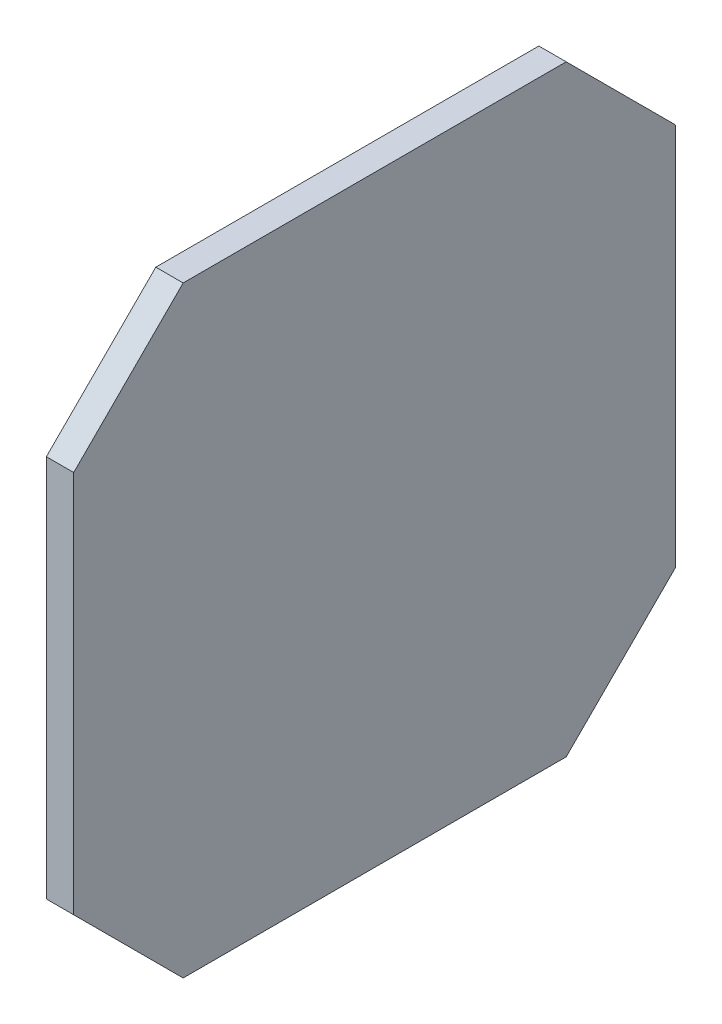
ISO-10303-21;
HEADER;
FILE_DESCRIPTION(('STEP AP214'),'2;1');
FILE_NAME('part.step','',(''),(''),'','','');
FILE_SCHEMA(('AUTOMOTIVE_DESIGN { 1 0 10303 214 1 1 1 1 }'));
ENDSEC;
DATA;
#1=APPLICATION_CONTEXT('core data for automotive mechanical design processes');
#2=APPLICATION_PROTOCOL_DEFINITION('international standard','automotive_design',2000,#1);
#3=PRODUCT_CONTEXT('',#1,'mechanical');
#4=PRODUCT('Part','Part','',(#3));
#5=PRODUCT_RELATED_PRODUCT_CATEGORY('part','',(#4));
#6=PRODUCT_DEFINITION_FORMATION('','',#4);
#7=PRODUCT_DEFINITION_CONTEXT('part definition',#1,'design');
#8=PRODUCT_DEFINITION('design','',#6,#7);
#9=PRODUCT_DEFINITION_SHAPE('','',#8);
#10=(LENGTH_UNIT() NAMED_UNIT(*) SI_UNIT(.MILLI.,.METRE.));
#11=(NAMED_UNIT(*) PLANE_ANGLE_UNIT() SI_UNIT($,.RADIAN.));
#12=(NAMED_UNIT(*) SI_UNIT($,.STERADIAN.) SOLID_ANGLE_UNIT());
#13=UNCERTAINTY_MEASURE_WITH_UNIT(LENGTH_MEASURE(1.E-05),#10,'distance_accuracy_value','');
#14=(GEOMETRIC_REPRESENTATION_CONTEXT(3) GLOBAL_UNCERTAINTY_ASSIGNED_CONTEXT((#13)) GLOBAL_UNIT_ASSIGNED_CONTEXT((#10,
#11,#12)) REPRESENTATION_CONTEXT('',''));
#15=CARTESIAN_POINT('',(0.,0.,0.));
#16=DIRECTION('',(0.,0.,1.));
#17=DIRECTION('',(1.,0.,0.));
#18=AXIS2_PLACEMENT_3D('',#15,#16,#17);
#19=CARTESIAN_POINT('',(3.175,0.,0.));
#20=DIRECTION('',(1.,0.,0.));
#21=DIRECTION('',(0.,0.,-1.));
#22=AXIS2_PLACEMENT_3D('',#19,#20,#21);
#23=PLANE('',#22);
#24=DIRECTION('',(0.,0.,1.));
#25=VECTOR('',#24,1.);
#26=CARTESIAN_POINT('',(3.175,69.85,-69.85));
#27=LINE('',#26,#25);
#28=CARTESIAN_POINT('',(3.175,69.85,-12.7));
#29=VERTEX_POINT('',#28);
#30=CARTESIAN_POINT('',(3.175,69.85,-57.15));
#31=VERTEX_POINT('',#30);
#32=EDGE_CURVE('E94',#29,#31,#27,.F.);
#33=ORIENTED_EDGE('',*,*,#32,.F.);
#34=DIRECTION('',(0.,-0.707106781186548,0.707106781186548));
#35=VECTOR('',#34,1.);
#36=CARTESIAN_POINT('',(3.175,63.5,-6.35));
#37=LINE('',#36,#35);
#38=CARTESIAN_POINT('',(3.175,57.15,0.));
#39=VERTEX_POINT('',#38);
#40=EDGE_CURVE('E20',#39,#29,#37,.F.);
#41=ORIENTED_EDGE('',*,*,#40,.F.);
#42=DIRECTION('',(0.,1.,0.));
#43=VECTOR('',#42,1.);
#44=CARTESIAN_POINT('',(3.175,69.85,0.));
#45=LINE('',#44,#43);
#46=CARTESIAN_POINT('',(3.175,12.7,0.));
#47=VERTEX_POINT('',#46);
#48=EDGE_CURVE('E83',#47,#39,#45,.T.);
#49=ORIENTED_EDGE('',*,*,#48,.F.);
#50=DIRECTION('',(0.,-0.707106781186548,-0.707106781186548));
#51=VECTOR('',#50,1.);
#52=CARTESIAN_POINT('',(3.175,6.35,-6.35));
#53=LINE('',#52,#51);
#54=CARTESIAN_POINT('',(3.175,0.,-12.7));
#55=VERTEX_POINT('',#54);
#56=EDGE_CURVE('E78',#55,#47,#53,.F.);
#57=ORIENTED_EDGE('',*,*,#56,.F.);
#58=DIRECTION('',(0.,0.,-1.));
#59=VECTOR('',#58,1.);
#60=CARTESIAN_POINT('',(3.175,0.,0.));
#61=LINE('',#60,#59);
#62=CARTESIAN_POINT('',(3.175,0.,-57.15));
#63=VERTEX_POINT('',#62);
#64=EDGE_CURVE('E105',#63,#55,#61,.F.);
#65=ORIENTED_EDGE('',*,*,#64,.F.);
#66=DIRECTION('',(0.,0.707106781186548,-0.707106781186548));
#67=VECTOR('',#66,1.);
#68=CARTESIAN_POINT('',(3.175,6.35,-63.5));
#69=LINE('',#68,#67);
#70=CARTESIAN_POINT('',(3.175,12.7,-69.85));
#71=VERTEX_POINT('',#70);
#72=EDGE_CURVE('E109',#71,#63,#69,.F.);
#73=ORIENTED_EDGE('',*,*,#72,.F.);
#74=DIRECTION('',(0.,1.,0.));
#75=VECTOR('',#74,1.);
#76=CARTESIAN_POINT('',(3.175,0.,-69.85));
#77=LINE('',#76,#75);
#78=CARTESIAN_POINT('',(3.175,57.15,-69.85));
#79=VERTEX_POINT('',#78);
#80=EDGE_CURVE('E113',#79,#71,#77,.F.);
#81=ORIENTED_EDGE('',*,*,#80,.F.);
#82=DIRECTION('',(0.,0.707106781186548,0.707106781186548));
#83=VECTOR('',#82,1.);
#84=CARTESIAN_POINT('',(3.175,63.5,-63.5));
#85=LINE('',#84,#83);
#86=EDGE_CURVE('E117',#31,#79,#85,.F.);
#87=ORIENTED_EDGE('',*,*,#86,.F.);
#88=EDGE_LOOP('',(#33,#41,#49,#57,#65,#73,#81,#87));
#89=FACE_BOUND('',#88,.T.);
#90=ADVANCED_FACE('F17',(#89),#23,.T.);
#91=CARTESIAN_POINT('',(1.5875,63.5,-6.35));
#92=DIRECTION('',(0.,0.707106781186548,0.707106781186548));
#93=DIRECTION('',(0.,-0.707106781186548,0.707106781186548));
#94=AXIS2_PLACEMENT_3D('',#91,#92,#93);
#95=PLANE('',#94);
#96=DIRECTION('',(1.,0.,0.));
#97=VECTOR('',#96,1.);
#98=CARTESIAN_POINT('',(0.,69.85,-12.7));
#99=LINE('',#98,#97);
#100=CARTESIAN_POINT('',(0.,69.85,-12.7));
#101=VERTEX_POINT('',#100);
#102=EDGE_CURVE('E123',#101,#29,#99,.T.);
#103=ORIENTED_EDGE('',*,*,#102,.F.);
#104=DIRECTION('',(0.,-0.707106781186547,0.707106781186548));
#105=VECTOR('',#104,1.);
#106=CARTESIAN_POINT('',(0.,69.85,-12.7));
#107=LINE('',#106,#105);
#108=CARTESIAN_POINT('',(0.,57.15,0.));
#109=VERTEX_POINT('',#108);
#110=EDGE_CURVE('E100',#101,#109,#107,.T.);
#111=ORIENTED_EDGE('',*,*,#110,.T.);
#112=DIRECTION('',(1.,0.,0.));
#113=VECTOR('',#112,1.);
#114=CARTESIAN_POINT('',(0.,57.15,0.));
#115=LINE('',#114,#113);
#116=EDGE_CURVE('E88',#39,#109,#115,.F.);
#117=ORIENTED_EDGE('',*,*,#116,.F.);
#118=ORIENTED_EDGE('',*,*,#40,.T.);
#119=EDGE_LOOP('',(#103,#111,#117,#118));
#120=FACE_BOUND('',#119,.T.);
#121=ADVANCED_FACE('F99',(#120),#95,.T.);
#122=CARTESIAN_POINT('',(0.,69.85,0.));
#123=DIRECTION('',(0.,0.,1.));
#124=DIRECTION('',(1.,0.,0.));
#125=AXIS2_PLACEMENT_3D('',#122,#123,#124);
#126=PLANE('',#125);
#127=ORIENTED_EDGE('',*,*,#48,.T.);
#128=ORIENTED_EDGE('',*,*,#116,.T.);
#129=DIRECTION('',(0.,1.,0.));
#130=VECTOR('',#129,1.);
#131=CARTESIAN_POINT('',(0.,0.,0.));
#132=LINE('',#131,#130);
#133=CARTESIAN_POINT('',(0.,12.7,0.));
#134=VERTEX_POINT('',#133);
#135=EDGE_CURVE('E126',#109,#134,#132,.F.);
#136=ORIENTED_EDGE('',*,*,#135,.T.);
#137=DIRECTION('',(1.,0.,0.));
#138=VECTOR('',#137,1.);
#139=CARTESIAN_POINT('',(1.5875,12.7,0.));
#140=LINE('',#139,#138);
#141=EDGE_CURVE('E90',#47,#134,#140,.F.);
#142=ORIENTED_EDGE('',*,*,#141,.F.);
#143=EDGE_LOOP('',(#127,#128,#136,#142));
#144=FACE_BOUND('',#143,.T.);
#145=ADVANCED_FACE('F85',(#144),#126,.T.);
#146=CARTESIAN_POINT('',(1.5875,6.35,-6.35));
#147=DIRECTION('',(0.,-0.707106781186548,0.707106781186548));
#148=DIRECTION('',(0.,-0.707106781186548,-0.707106781186548));
#149=AXIS2_PLACEMENT_3D('',#146,#147,#148);
#150=PLANE('',#149);
#151=ORIENTED_EDGE('',*,*,#141,.T.);
#152=DIRECTION('',(0.,-0.707106781186547,-0.707106781186547));
#153=VECTOR('',#152,1.);
#154=CARTESIAN_POINT('',(0.,12.7,0.));
#155=LINE('',#154,#153);
#156=CARTESIAN_POINT('',(0.,0.,-12.7));
#157=VERTEX_POINT('',#156);
#158=EDGE_CURVE('E128',#134,#157,#155,.T.);
#159=ORIENTED_EDGE('',*,*,#158,.T.);
#160=DIRECTION('',(1.,0.,0.));
#161=VECTOR('',#160,1.);
#162=CARTESIAN_POINT('',(0.,0.,-12.7));
#163=LINE('',#162,#161);
#164=EDGE_CURVE('E107',#55,#157,#163,.F.);
#165=ORIENTED_EDGE('',*,*,#164,.F.);
#166=ORIENTED_EDGE('',*,*,#56,.T.);
#167=EDGE_LOOP('',(#151,#159,#165,#166));
#168=FACE_BOUND('',#167,.T.);
#169=ADVANCED_FACE('F162',(#168),#150,.T.);
#170=CARTESIAN_POINT('',(0.,0.,0.));
#171=DIRECTION('',(0.,-1.,0.));
#172=DIRECTION('',(0.,0.,-1.));
#173=AXIS2_PLACEMENT_3D('',#170,#171,#172);
#174=PLANE('',#173);
#175=ORIENTED_EDGE('',*,*,#64,.T.);
#176=ORIENTED_EDGE('',*,*,#164,.T.);
#177=DIRECTION('',(0.,0.,-1.));
#178=VECTOR('',#177,1.);
#179=CARTESIAN_POINT('',(0.,0.,0.));
#180=LINE('',#179,#178);
#181=CARTESIAN_POINT('',(0.,0.,-57.15));
#182=VERTEX_POINT('',#181);
#183=EDGE_CURVE('E131',#157,#182,#180,.T.);
#184=ORIENTED_EDGE('',*,*,#183,.T.);
#185=DIRECTION('',(1.,0.,0.));
#186=VECTOR('',#185,1.);
#187=CARTESIAN_POINT('',(1.5875,0.,-57.15));
#188=LINE('',#187,#186);
#189=EDGE_CURVE('E111',#63,#182,#188,.F.);
#190=ORIENTED_EDGE('',*,*,#189,.F.);
#191=EDGE_LOOP('',(#175,#176,#184,#190));
#192=FACE_BOUND('',#191,.T.);
#193=ADVANCED_FACE('F161',(#192),#174,.T.);
#194=CARTESIAN_POINT('',(1.5875,6.35,-63.5));
#195=DIRECTION('',(0.,-0.707106781186548,-0.707106781186548));
#196=DIRECTION('',(0.,0.707106781186548,-0.707106781186548));
#197=AXIS2_PLACEMENT_3D('',#194,#195,#196);
#198=PLANE('',#197);
#199=ORIENTED_EDGE('',*,*,#189,.T.);
#200=DIRECTION('',(0.,0.707106781186548,-0.707106781186547));
#201=VECTOR('',#200,1.);
#202=CARTESIAN_POINT('',(0.,0.,-57.15));
#203=LINE('',#202,#201);
#204=CARTESIAN_POINT('',(0.,12.7,-69.85));
#205=VERTEX_POINT('',#204);
#206=EDGE_CURVE('E134',#182,#205,#203,.T.);
#207=ORIENTED_EDGE('',*,*,#206,.T.);
#208=DIRECTION('',(-1.,0.,0.));
#209=VECTOR('',#208,1.);
#210=CARTESIAN_POINT('',(0.,12.7,-69.85));
#211=LINE('',#210,#209);
#212=EDGE_CURVE('E115',#71,#205,#211,.T.);
#213=ORIENTED_EDGE('',*,*,#212,.F.);
#214=ORIENTED_EDGE('',*,*,#72,.T.);
#215=EDGE_LOOP('',(#199,#207,#213,#214));
#216=FACE_BOUND('',#215,.T.);
#217=ADVANCED_FACE('F155',(#216),#198,.T.);
#218=CARTESIAN_POINT('',(0.,0.,-69.85));
#219=DIRECTION('',(0.,0.,-1.));
#220=DIRECTION('',(-1.,0.,0.));
#221=AXIS2_PLACEMENT_3D('',#218,#219,#220);
#222=PLANE('',#221);
#223=DIRECTION('',(0.,1.,0.));
#224=VECTOR('',#223,1.);
#225=CARTESIAN_POINT('',(0.,0.,-69.85));
#226=LINE('',#225,#224);
#227=CARTESIAN_POINT('',(0.,57.15,-69.85));
#228=VERTEX_POINT('',#227);
#229=EDGE_CURVE('E137',#205,#228,#226,.T.);
#230=ORIENTED_EDGE('',*,*,#229,.T.);
#231=DIRECTION('',(1.,0.,0.));
#232=VECTOR('',#231,1.);
#233=CARTESIAN_POINT('',(1.5875,57.15,-69.85));
#234=LINE('',#233,#232);
#235=EDGE_CURVE('E119',#79,#228,#234,.F.);
#236=ORIENTED_EDGE('',*,*,#235,.F.);
#237=ORIENTED_EDGE('',*,*,#80,.T.);
#238=ORIENTED_EDGE('',*,*,#212,.T.);
#239=EDGE_LOOP('',(#230,#236,#237,#238));
#240=FACE_BOUND('',#239,.T.);
#241=ADVANCED_FACE('F150',(#240),#222,.T.);
#242=CARTESIAN_POINT('',(1.5875,63.5,-63.5));
#243=DIRECTION('',(0.,0.707106781186548,-0.707106781186548));
#244=DIRECTION('',(0.,0.707106781186548,0.707106781186548));
#245=AXIS2_PLACEMENT_3D('',#242,#243,#244);
#246=PLANE('',#245);
#247=ORIENTED_EDGE('',*,*,#235,.T.);
#248=DIRECTION('',(0.,0.707106781186548,0.707106781186548));
#249=VECTOR('',#248,1.);
#250=CARTESIAN_POINT('',(0.,57.15,-69.85));
#251=LINE('',#250,#249);
#252=CARTESIAN_POINT('',(0.,69.85,-57.15));
#253=VERTEX_POINT('',#252);
#254=EDGE_CURVE('E26',#228,#253,#251,.T.);
#255=ORIENTED_EDGE('',*,*,#254,.T.);
#256=DIRECTION('',(1.,0.,0.));
#257=VECTOR('',#256,1.);
#258=CARTESIAN_POINT('',(0.,69.85,-57.15));
#259=LINE('',#258,#257);
#260=EDGE_CURVE('E34',#31,#253,#259,.F.);
#261=ORIENTED_EDGE('',*,*,#260,.F.);
#262=ORIENTED_EDGE('',*,*,#86,.T.);
#263=EDGE_LOOP('',(#247,#255,#261,#262));
#264=FACE_BOUND('',#263,.T.);
#265=ADVANCED_FACE('F143',(#264),#246,.T.);
#266=CARTESIAN_POINT('',(0.,69.85,-69.85));
#267=DIRECTION('',(0.,1.,0.));
#268=DIRECTION('',(0.,0.,1.));
#269=AXIS2_PLACEMENT_3D('',#266,#267,#268);
#270=PLANE('',#269);
#271=DIRECTION('',(0.,0.,-1.));
#272=VECTOR('',#271,1.);
#273=CARTESIAN_POINT('',(0.,69.85,0.));
#274=LINE('',#273,#272);
#275=EDGE_CURVE('E11',#253,#101,#274,.F.);
#276=ORIENTED_EDGE('',*,*,#275,.T.);
#277=ORIENTED_EDGE('',*,*,#102,.T.);
#278=ORIENTED_EDGE('',*,*,#32,.T.);
#279=ORIENTED_EDGE('',*,*,#260,.T.);
#280=EDGE_LOOP('',(#276,#277,#278,#279));
#281=FACE_BOUND('',#280,.T.);
#282=ADVANCED_FACE('F163',(#281),#270,.T.);
#283=CARTESIAN_POINT('',(0.,0.,0.));
#284=DIRECTION('',(1.,0.,0.));
#285=DIRECTION('',(0.,0.,-1.));
#286=AXIS2_PLACEMENT_3D('',#283,#284,#285);
#287=PLANE('',#286);
#288=ORIENTED_EDGE('',*,*,#254,.F.);
#289=ORIENTED_EDGE('',*,*,#229,.F.);
#290=ORIENTED_EDGE('',*,*,#206,.F.);
#291=ORIENTED_EDGE('',*,*,#183,.F.);
#292=ORIENTED_EDGE('',*,*,#158,.F.);
#293=ORIENTED_EDGE('',*,*,#135,.F.);
#294=ORIENTED_EDGE('',*,*,#110,.F.);
#295=ORIENTED_EDGE('',*,*,#275,.F.);
#296=EDGE_LOOP('',(#288,#289,#290,#291,#292,#293,#294,#295));
#297=FACE_BOUND('',#296,.T.);
#298=ADVANCED_FACE('F147',(#297),#287,.F.);
#299=CLOSED_SHELL('',(#90,#121,#145,#169,#193,#217,#241,#265,#282,#298));
#300=MANIFOLD_SOLID_BREP('B1',#299);
#301=ADVANCED_BREP_SHAPE_REPRESENTATION('',(#18,#300),#14);
#302=SHAPE_DEFINITION_REPRESENTATION(#9,#301);
ENDSEC;
END-ISO-10303-21;
